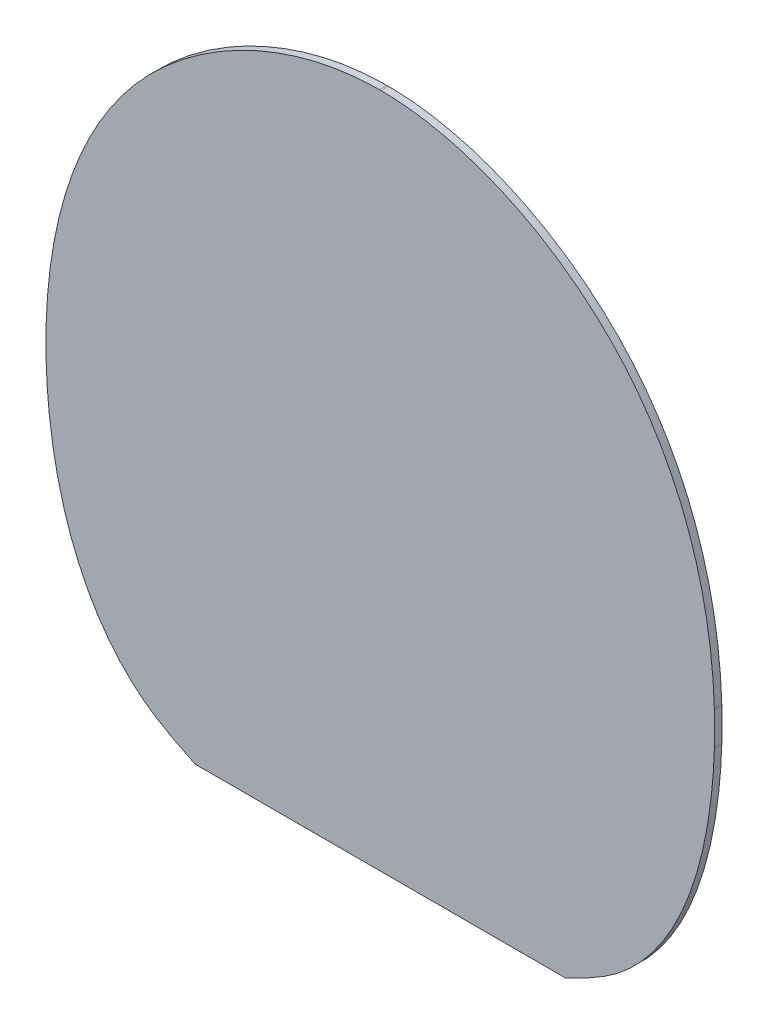
ISO-10303-21;
HEADER;
FILE_DESCRIPTION(('STEP AP214'),'2;1');
FILE_NAME('part.step','',(''),(''),'','','');
FILE_SCHEMA(('AUTOMOTIVE_DESIGN { 1 0 10303 214 1 1 1 1 }'));
ENDSEC;
DATA;
#1=APPLICATION_CONTEXT('core data for automotive mechanical design processes');
#2=APPLICATION_PROTOCOL_DEFINITION('international standard','automotive_design',2000,#1);
#3=PRODUCT_CONTEXT('',#1,'mechanical');
#4=PRODUCT('Part','Part','',(#3));
#5=PRODUCT_RELATED_PRODUCT_CATEGORY('part','',(#4));
#6=PRODUCT_DEFINITION_FORMATION('','',#4);
#7=PRODUCT_DEFINITION_CONTEXT('part definition',#1,'design');
#8=PRODUCT_DEFINITION('design','',#6,#7);
#9=PRODUCT_DEFINITION_SHAPE('','',#8);
#10=(LENGTH_UNIT() NAMED_UNIT(*) SI_UNIT(.MILLI.,.METRE.));
#11=(NAMED_UNIT(*) PLANE_ANGLE_UNIT() SI_UNIT($,.RADIAN.));
#12=(NAMED_UNIT(*) SI_UNIT($,.STERADIAN.) SOLID_ANGLE_UNIT());
#13=UNCERTAINTY_MEASURE_WITH_UNIT(LENGTH_MEASURE(1.E-05),#10,'distance_accuracy_value','');
#14=(GEOMETRIC_REPRESENTATION_CONTEXT(3) GLOBAL_UNCERTAINTY_ASSIGNED_CONTEXT((#13)) GLOBAL_UNIT_ASSIGNED_CONTEXT((#10,
#11,#12)) REPRESENTATION_CONTEXT('',''));
#15=CARTESIAN_POINT('',(0.,0.,0.));
#16=DIRECTION('',(0.,0.,1.));
#17=DIRECTION('',(1.,0.,0.));
#18=AXIS2_PLACEMENT_3D('',#15,#16,#17);
#19=CARTESIAN_POINT('',(0.,117.840442967415,2.));
#20=DIRECTION('',(0.,1.,0.));
#21=DIRECTION('',(-1.,0.,0.));
#22=AXIS2_PLACEMENT_3D('',#19,#20,#21);
#23=PLANE('',#22);
#24=DIRECTION('',(1.,0.,0.));
#25=VECTOR('',#24,1.);
#26=CARTESIAN_POINT('',(0.,117.840442967415,0.));
#27=LINE('',#26,#25);
#28=CARTESIAN_POINT('',(40.1010328394751,117.840442967415,0.));
#29=VERTEX_POINT('',#28);
#30=CARTESIAN_POINT('',(139.898967160525,117.840442967415,0.));
#31=VERTEX_POINT('',#30);
#32=EDGE_CURVE('E161',#29,#31,#27,.T.);
#33=ORIENTED_EDGE('',*,*,#32,.T.);
#34=DIRECTION('',(0.,0.,-1.));
#35=VECTOR('',#34,1.);
#36=CARTESIAN_POINT('',(139.898967160525,117.840442967415,2.));
#37=LINE('',#36,#35);
#38=CARTESIAN_POINT('',(139.898967160525,117.840442967415,2.));
#39=VERTEX_POINT('',#38);
#40=EDGE_CURVE('E11',#39,#31,#37,.T.);
#41=ORIENTED_EDGE('',*,*,#40,.F.);
#42=DIRECTION('',(1.,0.,0.));
#43=VECTOR('',#42,1.);
#44=CARTESIAN_POINT('',(0.,117.840442967415,2.));
#45=LINE('',#44,#43);
#46=CARTESIAN_POINT('',(40.1010328394751,117.840442967415,2.));
#47=VERTEX_POINT('',#46);
#48=EDGE_CURVE('E223',#47,#39,#45,.T.);
#49=ORIENTED_EDGE('',*,*,#48,.F.);
#50=DIRECTION('',(0.,0.,-1.));
#51=VECTOR('',#50,1.);
#52=CARTESIAN_POINT('',(40.1010328394751,117.840442967415,2.));
#53=LINE('',#52,#51);
#54=EDGE_CURVE('E60',#47,#29,#53,.T.);
#55=ORIENTED_EDGE('',*,*,#54,.T.);
#56=EDGE_LOOP('',(#33,#41,#49,#55));
#57=FACE_BOUND('',#56,.T.);
#58=ADVANCED_FACE('F40',(#57),#23,.F.);
#59=CARTESIAN_POINT('',(107.625262697057,86.9998596473512,2.));
#60=CARTESIAN_POINT('',(108.054143271881,95.9780781181096,2.));
#61=CARTESIAN_POINT('',(127.48664385242,113.866261667071,2.));
#62=CARTESIAN_POINT('',(148.895297768302,121.069134620661,2.));
#63=CARTESIAN_POINT('',(172.848320314368,142.893766889073,2.));
#64=CARTESIAN_POINT('',(186.885702417391,200.23626057864,2.));
#65=CARTESIAN_POINT('',(166.175836185028,274.66674408962,2.));
#66=CARTESIAN_POINT('',(113.013518293775,300.040860079915,2.));
#67=CARTESIAN_POINT('',(89.9999999999999,300.,2.));
#68=B_SPLINE_CURVE_WITH_KNOTS('',3,(#59,#60,#61,#62,#63,#64,#65,#66,#67),.UNSPECIFIED.,.F.,.F.,
(4,1,1,1,1,1,4),(0.,0.116860667780754,0.211663242380486,0.246387133981133,0.46409958378722,
0.758218729716948,1.),.UNSPECIFIED.);
#69=DIRECTION('',(0.,0.,-1.));
#70=VECTOR('',#69,1.);
#71=SURFACE_OF_LINEAR_EXTRUSION('',#68,#70);
#72=CARTESIAN_POINT('',(107.625262697057,86.9998596473512,0.));
#73=CARTESIAN_POINT('',(108.054143271881,95.9780781181096,0.));
#74=CARTESIAN_POINT('',(127.48664385242,113.866261667071,0.));
#75=CARTESIAN_POINT('',(148.895297768302,121.069134620661,0.));
#76=CARTESIAN_POINT('',(172.848320314368,142.893766889073,0.));
#77=CARTESIAN_POINT('',(186.885702417391,200.23626057864,0.));
#78=CARTESIAN_POINT('',(166.175836185028,274.66674408962,0.));
#79=CARTESIAN_POINT('',(113.013518293775,300.040860079915,0.));
#80=CARTESIAN_POINT('',(89.9999999999999,300.,0.));
#81=B_SPLINE_CURVE_WITH_KNOTS('',3,(#72,#73,#74,#75,#76,#77,#78,#79,#80),.UNSPECIFIED.,.F.,.F.,
(4,1,1,1,1,1,4),(0.,0.116860667780754,0.211663242380486,0.246387133981133,0.46409958378722,
0.758218729716948,1.),.UNSPECIFIED.);
#82=CARTESIAN_POINT('',(180.,191.650320350043,0.));
#83=VERTEX_POINT('',#82);
#84=EDGE_CURVE('E164',#31,#83,#81,.T.);
#85=ORIENTED_EDGE('',*,*,#84,.T.);
#86=DIRECTION('',(0.,0.,-1.));
#87=VECTOR('',#86,1.);
#88=CARTESIAN_POINT('',(180.,191.650320350043,2.));
#89=LINE('',#88,#87);
#90=CARTESIAN_POINT('',(180.,191.650320350043,2.));
#91=VERTEX_POINT('',#90);
#92=EDGE_CURVE('E49',#91,#83,#89,.T.);
#93=ORIENTED_EDGE('',*,*,#92,.F.);
#94=EDGE_CURVE('E109',#39,#91,#68,.T.);
#95=ORIENTED_EDGE('',*,*,#94,.F.);
#96=ORIENTED_EDGE('',*,*,#40,.T.);
#97=EDGE_LOOP('',(#85,#93,#95,#96));
#98=FACE_BOUND('',#97,.T.);
#99=ADVANCED_FACE('F240',(#98),#71,.F.);
#100=CARTESIAN_POINT('',(180.,0.,2.));
#101=DIRECTION('',(-1.,0.,0.));
#102=DIRECTION('',(0.,0.,1.));
#103=AXIS2_PLACEMENT_3D('',#100,#101,#102);
#104=PLANE('',#103);
#105=DIRECTION('',(0.,1.,0.));
#106=VECTOR('',#105,1.);
#107=CARTESIAN_POINT('',(180.,0.,0.));
#108=LINE('',#107,#106);
#109=CARTESIAN_POINT('',(180.,200.595525294128,0.));
#110=VERTEX_POINT('',#109);
#111=EDGE_CURVE('E169',#83,#110,#108,.T.);
#112=ORIENTED_EDGE('',*,*,#111,.T.);
#113=DIRECTION('',(0.,0.,-1.));
#114=VECTOR('',#113,1.);
#115=CARTESIAN_POINT('',(180.,200.595525294128,2.));
#116=LINE('',#115,#114);
#117=CARTESIAN_POINT('',(180.,200.595525294128,2.));
#118=VERTEX_POINT('',#117);
#119=EDGE_CURVE('E199',#118,#110,#116,.T.);
#120=ORIENTED_EDGE('',*,*,#119,.F.);
#121=DIRECTION('',(0.,1.,0.));
#122=VECTOR('',#121,1.);
#123=CARTESIAN_POINT('',(180.,0.,2.));
#124=LINE('',#123,#122);
#125=EDGE_CURVE('E209',#91,#118,#124,.T.);
#126=ORIENTED_EDGE('',*,*,#125,.F.);
#127=ORIENTED_EDGE('',*,*,#92,.T.);
#128=EDGE_LOOP('',(#112,#120,#126,#127));
#129=FACE_BOUND('',#128,.T.);
#130=ADVANCED_FACE('F207',(#129),#104,.F.);
#131=CARTESIAN_POINT('',(90.2456793186643,300.,0.));
#132=VERTEX_POINT('',#131);
#133=EDGE_CURVE('E170',#110,#132,#81,.T.);
#134=ORIENTED_EDGE('',*,*,#133,.T.);
#135=DIRECTION('',(0.,0.,-1.));
#136=VECTOR('',#135,1.);
#137=CARTESIAN_POINT('',(90.2456793186643,300.,2.));
#138=LINE('',#137,#136);
#139=CARTESIAN_POINT('',(90.2456793186643,300.,2.));
#140=VERTEX_POINT('',#139);
#141=EDGE_CURVE('E196',#140,#132,#138,.T.);
#142=ORIENTED_EDGE('',*,*,#141,.F.);
#143=EDGE_CURVE('E219',#118,#140,#68,.T.);
#144=ORIENTED_EDGE('',*,*,#143,.F.);
#145=ORIENTED_EDGE('',*,*,#119,.T.);
#146=EDGE_LOOP('',(#134,#142,#144,#145));
#147=FACE_BOUND('',#146,.T.);
#148=ADVANCED_FACE('F236',(#147),#71,.F.);
#149=CARTESIAN_POINT('',(0.,300.,2.));
#150=DIRECTION('',(0.,1.,0.));
#151=DIRECTION('',(0.,0.,1.));
#152=AXIS2_PLACEMENT_3D('',#149,#150,#151);
#153=PLANE('',#152);
#154=DIRECTION('',(1.,0.,0.));
#155=VECTOR('',#154,1.);
#156=CARTESIAN_POINT('',(0.,300.,0.));
#157=LINE('',#156,#155);
#158=CARTESIAN_POINT('',(89.7543206813302,300.,0.));
#159=VERTEX_POINT('',#158);
#160=EDGE_CURVE('E176',#159,#132,#157,.T.);
#161=ORIENTED_EDGE('',*,*,#160,.F.);
#162=DIRECTION('',(0.,0.,-1.));
#163=VECTOR('',#162,1.);
#164=CARTESIAN_POINT('',(89.7543206813302,300.,2.));
#165=LINE('',#164,#163);
#166=CARTESIAN_POINT('',(89.7543206813302,300.,2.));
#167=VERTEX_POINT('',#166);
#168=EDGE_CURVE('E137',#167,#159,#165,.T.);
#169=ORIENTED_EDGE('',*,*,#168,.F.);
#170=DIRECTION('',(1.,0.,0.));
#171=VECTOR('',#170,1.);
#172=CARTESIAN_POINT('',(0.,300.,2.));
#173=LINE('',#172,#171);
#174=EDGE_CURVE('E146',#167,#140,#173,.T.);
#175=ORIENTED_EDGE('',*,*,#174,.T.);
#176=ORIENTED_EDGE('',*,*,#141,.T.);
#177=EDGE_LOOP('',(#161,#169,#175,#176));
#178=FACE_BOUND('',#177,.T.);
#179=ADVANCED_FACE('F239',(#178),#153,.T.);
#180=CARTESIAN_POINT('',(72.3747373029428,86.9998596473512,2.));
#181=CARTESIAN_POINT('',(71.945856728119,95.9780781181096,2.));
#182=CARTESIAN_POINT('',(52.5133561475805,113.866261667071,2.));
#183=CARTESIAN_POINT('',(31.1047022316979,121.069134620661,2.));
#184=CARTESIAN_POINT('',(7.15167968563206,142.893766889073,2.));
#185=CARTESIAN_POINT('',(-6.88570241739131,200.23626057864,2.));
#186=CARTESIAN_POINT('',(13.8241638149721,274.66674408962,2.));
#187=CARTESIAN_POINT('',(66.9864817062248,300.040860079915,2.));
#188=CARTESIAN_POINT('',(90.0000000000001,300.,2.));
#189=B_SPLINE_CURVE_WITH_KNOTS('',3,(#180,#181,#182,#183,#184,#185,#186,#187,#188),
.UNSPECIFIED.,.F.,.F.,(4,1,1,1,1,1,4),(0.,0.116860667780754,0.211663242380486,0.246387133981133,
0.46409958378722,0.758218729716948,1.),.UNSPECIFIED.);
#190=DIRECTION('',(0.,0.,-1.));
#191=VECTOR('',#190,1.);
#192=SURFACE_OF_LINEAR_EXTRUSION('',#189,#191);
#193=CARTESIAN_POINT('',(72.3747373029428,86.9998596473512,0.));
#194=CARTESIAN_POINT('',(71.945856728119,95.9780781181096,0.));
#195=CARTESIAN_POINT('',(52.5133561475805,113.866261667071,0.));
#196=CARTESIAN_POINT('',(31.1047022316979,121.069134620661,0.));
#197=CARTESIAN_POINT('',(7.15167968563206,142.893766889073,0.));
#198=CARTESIAN_POINT('',(-6.88570241739131,200.23626057864,0.));
#199=CARTESIAN_POINT('',(13.8241638149721,274.66674408962,0.));
#200=CARTESIAN_POINT('',(66.9864817062248,300.040860079915,0.));
#201=CARTESIAN_POINT('',(90.0000000000001,300.,0.));
#202=B_SPLINE_CURVE_WITH_KNOTS('',3,(#193,#194,#195,#196,#197,#198,#199,#200,#201),
.UNSPECIFIED.,.F.,.F.,(4,1,1,1,1,1,4),(0.,0.116860667780754,0.211663242380486,0.246387133981133,
0.46409958378722,0.758218729716948,1.),.UNSPECIFIED.);
#203=CARTESIAN_POINT('',(0.,200.595525294128,0.));
#204=VERTEX_POINT('',#203);
#205=EDGE_CURVE('E132',#204,#159,#202,.T.);
#206=ORIENTED_EDGE('',*,*,#205,.F.);
#207=DIRECTION('',(0.,0.,-1.));
#208=VECTOR('',#207,1.);
#209=CARTESIAN_POINT('',(0.,200.595525294128,2.));
#210=LINE('',#209,#208);
#211=CARTESIAN_POINT('',(0.,200.595525294128,2.));
#212=VERTEX_POINT('',#211);
#213=EDGE_CURVE('E127',#212,#204,#210,.T.);
#214=ORIENTED_EDGE('',*,*,#213,.F.);
#215=EDGE_CURVE('E130',#212,#167,#189,.T.);
#216=ORIENTED_EDGE('',*,*,#215,.T.);
#217=ORIENTED_EDGE('',*,*,#168,.T.);
#218=EDGE_LOOP('',(#206,#214,#216,#217));
#219=FACE_BOUND('',#218,.T.);
#220=ADVANCED_FACE('F129',(#219),#192,.T.);
#221=CARTESIAN_POINT('',(0.,0.,2.));
#222=DIRECTION('',(-1.,0.,0.));
#223=DIRECTION('',(0.,0.,1.));
#224=AXIS2_PLACEMENT_3D('',#221,#222,#223);
#225=PLANE('',#224);
#226=DIRECTION('',(0.,1.,0.));
#227=VECTOR('',#226,1.);
#228=CARTESIAN_POINT('',(0.,0.,0.));
#229=LINE('',#228,#227);
#230=CARTESIAN_POINT('',(0.,191.650320350044,0.));
#231=VERTEX_POINT('',#230);
#232=EDGE_CURVE('E184',#231,#204,#229,.T.);
#233=ORIENTED_EDGE('',*,*,#232,.F.);
#234=DIRECTION('',(0.,0.,-1.));
#235=VECTOR('',#234,1.);
#236=CARTESIAN_POINT('',(0.,191.650320350044,2.));
#237=LINE('',#236,#235);
#238=CARTESIAN_POINT('',(0.,191.650320350044,2.));
#239=VERTEX_POINT('',#238);
#240=EDGE_CURVE('E95',#239,#231,#237,.T.);
#241=ORIENTED_EDGE('',*,*,#240,.F.);
#242=DIRECTION('',(0.,1.,0.));
#243=VECTOR('',#242,1.);
#244=CARTESIAN_POINT('',(0.,0.,2.));
#245=LINE('',#244,#243);
#246=EDGE_CURVE('E144',#239,#212,#245,.T.);
#247=ORIENTED_EDGE('',*,*,#246,.T.);
#248=ORIENTED_EDGE('',*,*,#213,.T.);
#249=EDGE_LOOP('',(#233,#241,#247,#248));
#250=FACE_BOUND('',#249,.T.);
#251=ADVANCED_FACE('F150',(#250),#225,.T.);
#252=EDGE_CURVE('E185',#29,#231,#202,.T.);
#253=ORIENTED_EDGE('',*,*,#252,.F.);
#254=ORIENTED_EDGE('',*,*,#54,.F.);
#255=EDGE_CURVE('E149',#47,#239,#189,.T.);
#256=ORIENTED_EDGE('',*,*,#255,.T.);
#257=ORIENTED_EDGE('',*,*,#240,.T.);
#258=EDGE_LOOP('',(#253,#254,#256,#257));
#259=FACE_BOUND('',#258,.T.);
#260=ADVANCED_FACE('F250',(#259),#192,.T.);
#261=CARTESIAN_POINT('',(0.,0.,2.));
#262=DIRECTION('',(0.,0.,1.));
#263=DIRECTION('',(1.,0.,0.));
#264=AXIS2_PLACEMENT_3D('',#261,#262,#263);
#265=PLANE('',#264);
#266=ORIENTED_EDGE('',*,*,#48,.T.);
#267=ORIENTED_EDGE('',*,*,#94,.T.);
#268=ORIENTED_EDGE('',*,*,#125,.T.);
#269=ORIENTED_EDGE('',*,*,#143,.T.);
#270=ORIENTED_EDGE('',*,*,#174,.F.);
#271=ORIENTED_EDGE('',*,*,#215,.F.);
#272=ORIENTED_EDGE('',*,*,#246,.F.);
#273=ORIENTED_EDGE('',*,*,#255,.F.);
#274=EDGE_LOOP('',(#266,#267,#268,#269,#270,#271,#272,#273));
#275=FACE_BOUND('',#274,.T.);
#276=ADVANCED_FACE('F142',(#275),#265,.T.);
#277=CARTESIAN_POINT('',(0.,0.,0.));
#278=DIRECTION('',(0.,0.,1.));
#279=DIRECTION('',(1.,0.,0.));
#280=AXIS2_PLACEMENT_3D('',#277,#278,#279);
#281=PLANE('',#280);
#282=ORIENTED_EDGE('',*,*,#32,.F.);
#283=ORIENTED_EDGE('',*,*,#252,.T.);
#284=ORIENTED_EDGE('',*,*,#232,.T.);
#285=ORIENTED_EDGE('',*,*,#205,.T.);
#286=ORIENTED_EDGE('',*,*,#160,.T.);
#287=ORIENTED_EDGE('',*,*,#133,.F.);
#288=ORIENTED_EDGE('',*,*,#111,.F.);
#289=ORIENTED_EDGE('',*,*,#84,.F.);
#290=EDGE_LOOP('',(#282,#283,#284,#285,#286,#287,#288,#289));
#291=FACE_BOUND('',#290,.T.);
#292=ADVANCED_FACE('F212',(#291),#281,.F.);
#293=CLOSED_SHELL('',(#58,#99,#130,#148,#179,#220,#251,#260,#276,#292));
#294=MANIFOLD_SOLID_BREP('B2',#293);
#295=ADVANCED_BREP_SHAPE_REPRESENTATION('',(#18,#294),#14);
#296=SHAPE_DEFINITION_REPRESENTATION(#9,#295);
ENDSEC;
END-ISO-10303-21;
